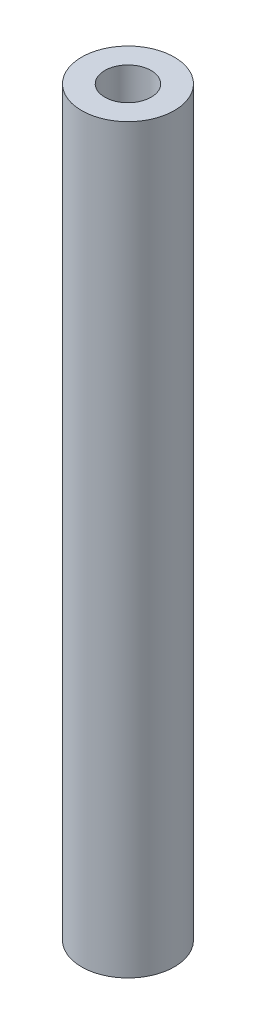
ISO-10303-21;
HEADER;
FILE_DESCRIPTION(('STEP AP214'),'2;1');
FILE_NAME('part.step','',(''),(''),'','','');
FILE_SCHEMA(('AUTOMOTIVE_DESIGN { 1 0 10303 214 1 1 1 1 }'));
ENDSEC;
DATA;
#1=APPLICATION_CONTEXT('core data for automotive mechanical design processes');
#2=APPLICATION_PROTOCOL_DEFINITION('international standard','automotive_design',2000,#1);
#3=PRODUCT_CONTEXT('',#1,'mechanical');
#4=PRODUCT('Part','Part','',(#3));
#5=PRODUCT_RELATED_PRODUCT_CATEGORY('part','',(#4));
#6=PRODUCT_DEFINITION_FORMATION('','',#4);
#7=PRODUCT_DEFINITION_CONTEXT('part definition',#1,'design');
#8=PRODUCT_DEFINITION('design','',#6,#7);
#9=PRODUCT_DEFINITION_SHAPE('','',#8);
#10=(LENGTH_UNIT() NAMED_UNIT(*) SI_UNIT(.MILLI.,.METRE.));
#11=(NAMED_UNIT(*) PLANE_ANGLE_UNIT() SI_UNIT($,.RADIAN.));
#12=(NAMED_UNIT(*) SI_UNIT($,.STERADIAN.) SOLID_ANGLE_UNIT());
#13=UNCERTAINTY_MEASURE_WITH_UNIT(LENGTH_MEASURE(1.E-05),#10,'distance_accuracy_value','');
#14=(GEOMETRIC_REPRESENTATION_CONTEXT(3) GLOBAL_UNCERTAINTY_ASSIGNED_CONTEXT((#13)) GLOBAL_UNIT_ASSIGNED_CONTEXT((#10,
#11,#12)) REPRESENTATION_CONTEXT('',''));
#15=CARTESIAN_POINT('',(0.,0.,0.));
#16=DIRECTION('',(0.,0.,1.));
#17=DIRECTION('',(1.,0.,0.));
#18=AXIS2_PLACEMENT_3D('',#15,#16,#17);
#19=CARTESIAN_POINT('',(0.,80.,0.));
#20=DIRECTION('',(0.,1.,0.));
#21=DIRECTION('',(0.,0.,1.));
#22=AXIS2_PLACEMENT_3D('',#19,#20,#21);
#23=PLANE('',#22);
#24=CARTESIAN_POINT('',(0.,80.,0.));
#25=DIRECTION('',(0.,1.,0.));
#26=DIRECTION('',(0.,0.,1.));
#27=AXIS2_PLACEMENT_3D('',#24,#25,#26);
#28=CIRCLE('',#27,5.);
#29=CARTESIAN_POINT('',(0.,80.,5.));
#30=VERTEX_POINT('',#29);
#31=EDGE_CURVE('E10',#30,#30,#28,.T.);
#32=ORIENTED_EDGE('',*,*,#31,.T.);
#33=EDGE_LOOP('',(#32));
#34=FACE_BOUND('',#33,.T.);
#35=CARTESIAN_POINT('',(0.,80.,0.));
#36=DIRECTION('',(0.,1.,0.));
#37=DIRECTION('',(0.,0.,1.));
#38=AXIS2_PLACEMENT_3D('',#35,#36,#37);
#39=CIRCLE('',#38,2.5);
#40=CARTESIAN_POINT('',(0.,80.,2.5));
#41=VERTEX_POINT('',#40);
#42=EDGE_CURVE('E43',#41,#41,#39,.T.);
#43=ORIENTED_EDGE('',*,*,#42,.F.);
#44=EDGE_LOOP('',(#43));
#45=FACE_BOUND('',#44,.T.);
#46=ADVANCED_FACE('F32',(#34,#45),#23,.T.);
#47=CARTESIAN_POINT('',(0.,0.,0.));
#48=DIRECTION('',(0.,1.,0.));
#49=DIRECTION('',(0.,0.,1.));
#50=AXIS2_PLACEMENT_3D('',#47,#48,#49);
#51=PLANE('',#50);
#52=CARTESIAN_POINT('',(0.,0.,0.));
#53=DIRECTION('',(0.,1.,0.));
#54=DIRECTION('',(0.,0.,1.));
#55=AXIS2_PLACEMENT_3D('',#52,#53,#54);
#56=CIRCLE('',#55,5.);
#57=CARTESIAN_POINT('',(0.,0.,5.));
#58=VERTEX_POINT('',#57);
#59=EDGE_CURVE('E36',#58,#58,#56,.T.);
#60=ORIENTED_EDGE('',*,*,#59,.F.);
#61=EDGE_LOOP('',(#60));
#62=FACE_BOUND('',#61,.T.);
#63=CARTESIAN_POINT('',(0.,0.,0.));
#64=DIRECTION('',(0.,1.,0.));
#65=DIRECTION('',(0.,0.,1.));
#66=AXIS2_PLACEMENT_3D('',#63,#64,#65);
#67=CIRCLE('',#66,2.5);
#68=CARTESIAN_POINT('',(0.,0.,2.5));
#69=VERTEX_POINT('',#68);
#70=EDGE_CURVE('E45',#69,#69,#67,.T.);
#71=ORIENTED_EDGE('',*,*,#70,.T.);
#72=EDGE_LOOP('',(#71));
#73=FACE_BOUND('',#72,.T.);
#74=ADVANCED_FACE('F55',(#62,#73),#51,.F.);
#75=CARTESIAN_POINT('',(0.,80.,0.));
#76=DIRECTION('',(0.,-1.,0.));
#77=DIRECTION('',(0.,0.,-1.));
#78=AXIS2_PLACEMENT_3D('',#75,#76,#77);
#79=CYLINDRICAL_SURFACE('',#78,5.);
#80=ORIENTED_EDGE('',*,*,#31,.F.);
#81=EDGE_LOOP('',(#80));
#82=FACE_BOUND('',#81,.T.);
#83=ORIENTED_EDGE('',*,*,#59,.T.);
#84=EDGE_LOOP('',(#83));
#85=FACE_BOUND('',#84,.T.);
#86=ADVANCED_FACE('F34',(#82,#85),#79,.T.);
#87=CARTESIAN_POINT('',(0.,80.,0.));
#88=DIRECTION('',(0.,-1.,0.));
#89=DIRECTION('',(0.,0.,-1.));
#90=AXIS2_PLACEMENT_3D('',#87,#88,#89);
#91=CYLINDRICAL_SURFACE('',#90,2.5);
#92=ORIENTED_EDGE('',*,*,#42,.T.);
#93=EDGE_LOOP('',(#92));
#94=FACE_BOUND('',#93,.T.);
#95=ORIENTED_EDGE('',*,*,#70,.F.);
#96=EDGE_LOOP('',(#95));
#97=FACE_BOUND('',#96,.T.);
#98=ADVANCED_FACE('F51',(#94,#97),#91,.F.);
#99=CLOSED_SHELL('',(#46,#74,#86,#98));
#100=MANIFOLD_SOLID_BREP('B2',#99);
#101=ADVANCED_BREP_SHAPE_REPRESENTATION('',(#18,#100),#14);
#102=SHAPE_DEFINITION_REPRESENTATION(#9,#101);
ENDSEC;
END-ISO-10303-21;
